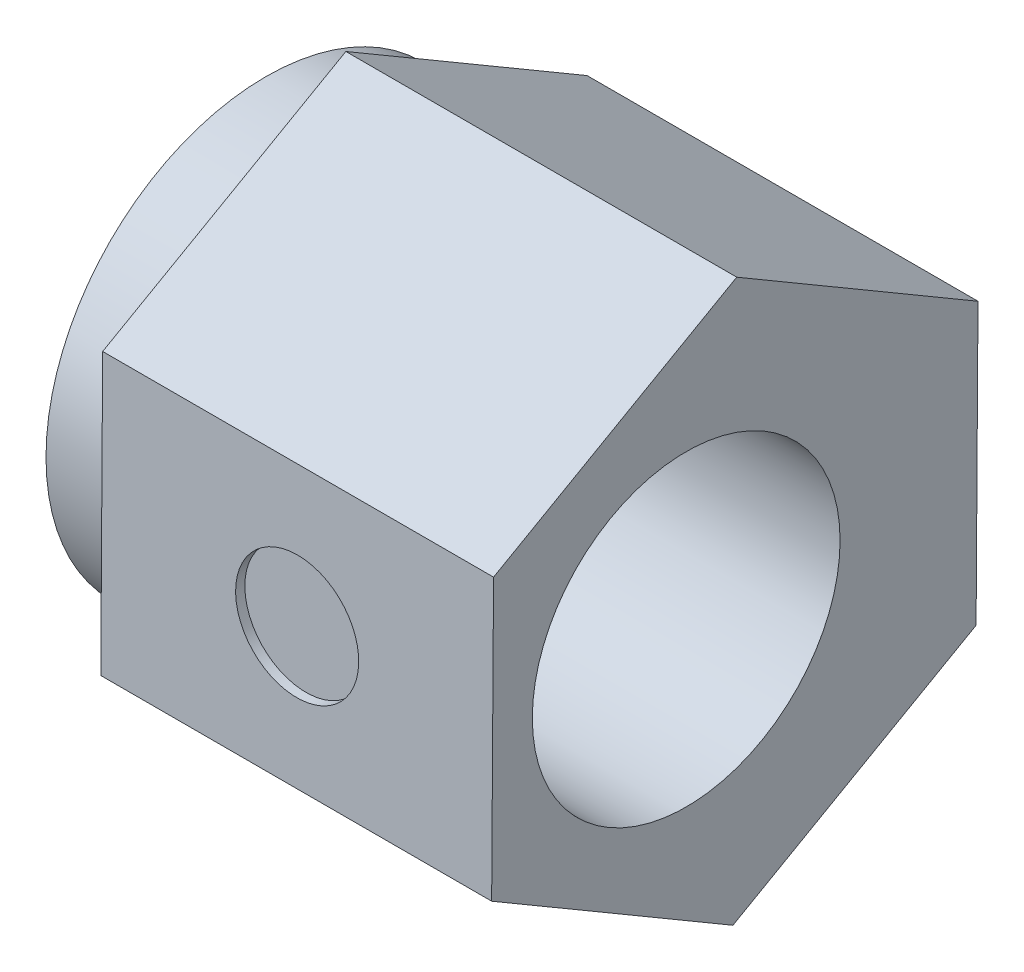
ISO-10303-21;
HEADER;
FILE_DESCRIPTION(('STEP AP214'),'2;1');
FILE_NAME('part.step','',(''),(''),'','','');
FILE_SCHEMA(('AUTOMOTIVE_DESIGN { 1 0 10303 214 1 1 1 1 }'));
ENDSEC;
DATA;
#1=APPLICATION_CONTEXT('core data for automotive mechanical design processes');
#2=APPLICATION_PROTOCOL_DEFINITION('international standard','automotive_design',2000,#1);
#3=PRODUCT_CONTEXT('',#1,'mechanical');
#4=PRODUCT('Part','Part','',(#3));
#5=PRODUCT_RELATED_PRODUCT_CATEGORY('part','',(#4));
#6=PRODUCT_DEFINITION_FORMATION('','',#4);
#7=PRODUCT_DEFINITION_CONTEXT('part definition',#1,'design');
#8=PRODUCT_DEFINITION('design','',#6,#7);
#9=PRODUCT_DEFINITION_SHAPE('','',#8);
#10=(LENGTH_UNIT() NAMED_UNIT(*) SI_UNIT(.MILLI.,.METRE.));
#11=(NAMED_UNIT(*) PLANE_ANGLE_UNIT() SI_UNIT($,.RADIAN.));
#12=(NAMED_UNIT(*) SI_UNIT($,.STERADIAN.) SOLID_ANGLE_UNIT());
#13=UNCERTAINTY_MEASURE_WITH_UNIT(LENGTH_MEASURE(1.E-05),#10,'distance_accuracy_value','');
#14=(GEOMETRIC_REPRESENTATION_CONTEXT(3) GLOBAL_UNCERTAINTY_ASSIGNED_CONTEXT((#13)) GLOBAL_UNIT_ASSIGNED_CONTEXT((#10,
#11,#12)) REPRESENTATION_CONTEXT('',''));
#15=CARTESIAN_POINT('',(0.,0.,0.));
#16=DIRECTION('',(0.,0.,1.));
#17=DIRECTION('',(1.,0.,0.));
#18=AXIS2_PLACEMENT_3D('',#15,#16,#17);
#19=CARTESIAN_POINT('',(6.35,2.29861751972744,3.91943756568916));
#20=DIRECTION('',(0.,-0.00680988299330344,-0.999976812477978));
#21=DIRECTION('',(0.,0.999976812477978,-0.00680988299330344));
#22=AXIS2_PLACEMENT_3D('',#19,#20,#21);
#23=PLANE('',#22);
#24=DIRECTION('',(0.,-0.999976812477978,0.00680988299330344));
#25=VECTOR('',#24,1.);
#26=CARTESIAN_POINT('',(0.,2.29861751972744,3.91943756568916));
#27=LINE('',#26,#25);
#28=CARTESIAN_POINT('',(0.,2.29861751972744,3.91943756568916));
#29=VERTEX_POINT('',#28);
#30=CARTESIAN_POINT('',(0.,-2.24502374057014,3.95037994851252));
#31=VERTEX_POINT('',#30);
#32=EDGE_CURVE('E77',#29,#31,#27,.T.);
#33=ORIENTED_EDGE('',*,*,#32,.T.);
#34=DIRECTION('',(-1.,0.,0.));
#35=VECTOR('',#34,1.);
#36=CARTESIAN_POINT('',(6.35,-2.24502374057014,3.95037994851252));
#37=LINE('',#36,#35);
#38=CARTESIAN_POINT('',(6.35,-2.24502374057014,3.95037994851252));
#39=VERTEX_POINT('',#38);
#40=EDGE_CURVE('E117',#39,#31,#37,.T.);
#41=ORIENTED_EDGE('',*,*,#40,.F.);
#42=DIRECTION('',(0.,-0.999976812477978,0.00680988299330344));
#43=VECTOR('',#42,1.);
#44=CARTESIAN_POINT('',(6.35,2.29861751972744,3.91943756568916));
#45=LINE('',#44,#43);
#46=CARTESIAN_POINT('',(6.35,2.29861751972744,3.91943756568916));
#47=VERTEX_POINT('',#46);
#48=EDGE_CURVE('E103',#47,#39,#45,.T.);
#49=ORIENTED_EDGE('',*,*,#48,.F.);
#50=DIRECTION('',(-1.,0.,0.));
#51=VECTOR('',#50,1.);
#52=CARTESIAN_POINT('',(6.35,2.29861751972744,3.91943756568916));
#53=LINE('',#52,#51);
#54=EDGE_CURVE('E111',#47,#29,#53,.T.);
#55=ORIENTED_EDGE('',*,*,#54,.T.);
#56=EDGE_LOOP('',(#33,#41,#49,#55));
#57=FACE_BOUND('',#56,.T.);
#58=CARTESIAN_POINT('',(3.175,0.026796889578649,3.93490875710084));
#59=DIRECTION('',(0.,-0.00680988299330344,-0.999976812477978));
#60=DIRECTION('',(0.,0.999976812477978,-0.00680988299330344));
#61=AXIS2_PLACEMENT_3D('',#58,#59,#60);
#62=CIRCLE('',#61,0.999999999999998);
#63=CARTESIAN_POINT('',(3.175,1.02677370205663,3.92809887410754));
#64=VERTEX_POINT('',#63);
#65=EDGE_CURVE('E184',#64,#64,#62,.T.);
#66=ORIENTED_EDGE('',*,*,#65,.T.);
#67=EDGE_LOOP('',(#66));
#68=FACE_BOUND('',#67,.T.);
#69=ADVANCED_FACE('F36',(#57,#68),#23,.F.);
#70=CARTESIAN_POINT('',(0.,0.,0.));
#71=DIRECTION('',(1.,0.,0.));
#72=DIRECTION('',(0.,0.,-1.));
#73=AXIS2_PLACEMENT_3D('',#70,#71,#72);
#74=PLANE('',#73);
#75=DIRECTION('',(0.,0.494090874569989,-0.869410264297968));
#76=VECTOR('',#75,1.);
#77=CARTESIAN_POINT('',(0.,-4.54364126029758,0.0309423828233433));
#78=LINE('',#77,#76);
#79=CARTESIAN_POINT('',(0.,-4.54364126029758,0.0309423828233433));
#80=VERTEX_POINT('',#79);
#81=CARTESIAN_POINT('',(0.,-2.29861751972745,-3.91943756568916));
#82=VERTEX_POINT('',#81);
#83=EDGE_CURVE('E129',#80,#82,#78,.T.);
#84=ORIENTED_EDGE('',*,*,#83,.F.);
#85=DIRECTION('',(0.,-0.50588593790799,-0.862600381304665));
#86=VECTOR('',#85,1.);
#87=CARTESIAN_POINT('',(0.,-2.24502374057014,3.95037994851252));
#88=LINE('',#87,#86);
#89=EDGE_CURVE('E83',#31,#80,#88,.T.);
#90=ORIENTED_EDGE('',*,*,#89,.F.);
#91=ORIENTED_EDGE('',*,*,#32,.F.);
#92=DIRECTION('',(0.,-0.494090874569989,0.869410264297968));
#93=VECTOR('',#92,1.);
#94=CARTESIAN_POINT('',(0.,4.54364126029758,-0.0309423828233572));
#95=LINE('',#94,#93);
#96=CARTESIAN_POINT('',(0.,4.54364126029758,-0.0309423828233572));
#97=VERTEX_POINT('',#96);
#98=EDGE_CURVE('E114',#97,#29,#95,.T.);
#99=ORIENTED_EDGE('',*,*,#98,.F.);
#100=DIRECTION('',(0.,0.505885937907989,0.862600381304665));
#101=VECTOR('',#100,1.);
#102=CARTESIAN_POINT('',(0.,2.24502374057014,-3.95037994851252));
#103=LINE('',#102,#101);
#104=CARTESIAN_POINT('',(0.,2.24502374057014,-3.95037994851252));
#105=VERTEX_POINT('',#104);
#106=EDGE_CURVE('E137',#105,#97,#103,.T.);
#107=ORIENTED_EDGE('',*,*,#106,.F.);
#108=DIRECTION('',(0.,0.999976812477978,-0.00680988299330266));
#109=VECTOR('',#108,1.);
#110=CARTESIAN_POINT('',(0.,-2.29861751972745,-3.91943756568916));
#111=LINE('',#110,#109);
#112=EDGE_CURVE('E133',#82,#105,#111,.T.);
#113=ORIENTED_EDGE('',*,*,#112,.F.);
#114=EDGE_LOOP('',(#84,#90,#91,#99,#107,#113));
#115=FACE_BOUND('',#114,.T.);
#116=CARTESIAN_POINT('',(0.,0.,0.));
#117=DIRECTION('',(1.,0.,0.));
#118=DIRECTION('',(0.,0.,-1.));
#119=AXIS2_PLACEMENT_3D('',#116,#117,#118);
#120=CIRCLE('',#119,3.57);
#121=CARTESIAN_POINT('',(0.,0.,-3.57));
#122=VERTEX_POINT('',#121);
#123=EDGE_CURVE('E11',#122,#122,#120,.F.);
#124=ORIENTED_EDGE('',*,*,#123,.F.);
#125=EDGE_LOOP('',(#124));
#126=FACE_BOUND('',#125,.T.);
#127=ADVANCED_FACE('F162',(#115,#126),#74,.F.);
#128=CARTESIAN_POINT('',(6.35,-4.54364126029758,0.0309423828233433));
#129=DIRECTION('',(0.,0.869410264297968,0.494090874569989));
#130=DIRECTION('',(0.,-0.494090874569989,0.869410264297969));
#131=AXIS2_PLACEMENT_3D('',#128,#129,#130);
#132=PLANE('',#131);
#133=ORIENTED_EDGE('',*,*,#83,.T.);
#134=DIRECTION('',(-1.,0.,0.));
#135=VECTOR('',#134,1.);
#136=CARTESIAN_POINT('',(6.35,-2.29861751972745,-3.91943756568916));
#137=LINE('',#136,#135);
#138=CARTESIAN_POINT('',(6.35,-2.29861751972745,-3.91943756568916));
#139=VERTEX_POINT('',#138);
#140=EDGE_CURVE('E46',#139,#82,#137,.T.);
#141=ORIENTED_EDGE('',*,*,#140,.F.);
#142=DIRECTION('',(0.,0.494090874569989,-0.869410264297968));
#143=VECTOR('',#142,1.);
#144=CARTESIAN_POINT('',(6.35,-4.54364126029758,0.0309423828233433));
#145=LINE('',#144,#143);
#146=CARTESIAN_POINT('',(6.35,-4.54364126029758,0.0309423828233433));
#147=VERTEX_POINT('',#146);
#148=EDGE_CURVE('E145',#147,#139,#145,.T.);
#149=ORIENTED_EDGE('',*,*,#148,.F.);
#150=DIRECTION('',(-1.,0.,0.));
#151=VECTOR('',#150,1.);
#152=CARTESIAN_POINT('',(6.35,-4.54364126029758,0.0309423828233433));
#153=LINE('',#152,#151);
#154=EDGE_CURVE('E125',#147,#80,#153,.T.);
#155=ORIENTED_EDGE('',*,*,#154,.T.);
#156=EDGE_LOOP('',(#133,#141,#149,#155));
#157=FACE_BOUND('',#156,.T.);
#158=ADVANCED_FACE('F38',(#157),#132,.F.);
#159=CARTESIAN_POINT('',(6.35,-2.29861751972745,-3.91943756568916));
#160=DIRECTION('',(0.,0.00680988299330266,0.999976812477978));
#161=DIRECTION('',(0.,-0.999976812477978,0.00680988299330266));
#162=AXIS2_PLACEMENT_3D('',#159,#160,#161);
#163=PLANE('',#162);
#164=ORIENTED_EDGE('',*,*,#112,.T.);
#165=DIRECTION('',(-1.,0.,0.));
#166=VECTOR('',#165,1.);
#167=CARTESIAN_POINT('',(6.35,2.24502374057014,-3.95037994851252));
#168=LINE('',#167,#166);
#169=CARTESIAN_POINT('',(6.35,2.24502374057014,-3.95037994851252));
#170=VERTEX_POINT('',#169);
#171=EDGE_CURVE('E151',#170,#105,#168,.T.);
#172=ORIENTED_EDGE('',*,*,#171,.F.);
#173=DIRECTION('',(0.,0.999976812477978,-0.00680988299330266));
#174=VECTOR('',#173,1.);
#175=CARTESIAN_POINT('',(6.35,-2.29861751972745,-3.91943756568916));
#176=LINE('',#175,#174);
#177=EDGE_CURVE('E92',#139,#170,#176,.T.);
#178=ORIENTED_EDGE('',*,*,#177,.F.);
#179=ORIENTED_EDGE('',*,*,#140,.T.);
#180=EDGE_LOOP('',(#164,#172,#178,#179));
#181=FACE_BOUND('',#180,.T.);
#182=ADVANCED_FACE('F157',(#181),#163,.F.);
#183=CARTESIAN_POINT('',(6.35,2.24502374057014,-3.95037994851252));
#184=DIRECTION('',(0.,-0.862600381304665,0.505885937907989));
#185=DIRECTION('',(0.,-0.505885937907989,-0.862600381304665));
#186=AXIS2_PLACEMENT_3D('',#183,#184,#185);
#187=PLANE('',#186);
#188=ORIENTED_EDGE('',*,*,#106,.T.);
#189=DIRECTION('',(-1.,0.,0.));
#190=VECTOR('',#189,1.);
#191=CARTESIAN_POINT('',(6.35,4.54364126029758,-0.0309423828233572));
#192=LINE('',#191,#190);
#193=CARTESIAN_POINT('',(6.35,4.54364126029758,-0.0309423828233572));
#194=VERTEX_POINT('',#193);
#195=EDGE_CURVE('E116',#194,#97,#192,.T.);
#196=ORIENTED_EDGE('',*,*,#195,.F.);
#197=DIRECTION('',(0.,0.505885937907989,0.862600381304665));
#198=VECTOR('',#197,1.);
#199=CARTESIAN_POINT('',(6.35,2.24502374057014,-3.95037994851252));
#200=LINE('',#199,#198);
#201=EDGE_CURVE('E105',#170,#194,#200,.T.);
#202=ORIENTED_EDGE('',*,*,#201,.F.);
#203=ORIENTED_EDGE('',*,*,#171,.T.);
#204=EDGE_LOOP('',(#188,#196,#202,#203));
#205=FACE_BOUND('',#204,.T.);
#206=ADVANCED_FACE('F166',(#205),#187,.F.);
#207=CARTESIAN_POINT('',(6.35,4.54364126029758,-0.0309423828233572));
#208=DIRECTION('',(0.,-0.869410264297968,-0.494090874569989));
#209=DIRECTION('',(0.,0.494090874569989,-0.869410264297969));
#210=AXIS2_PLACEMENT_3D('',#207,#208,#209);
#211=PLANE('',#210);
#212=ORIENTED_EDGE('',*,*,#98,.T.);
#213=ORIENTED_EDGE('',*,*,#54,.F.);
#214=DIRECTION('',(0.,-0.494090874569989,0.869410264297968));
#215=VECTOR('',#214,1.);
#216=CARTESIAN_POINT('',(6.35,4.54364126029758,-0.0309423828233572));
#217=LINE('',#216,#215);
#218=EDGE_CURVE('E99',#194,#47,#217,.T.);
#219=ORIENTED_EDGE('',*,*,#218,.F.);
#220=ORIENTED_EDGE('',*,*,#195,.T.);
#221=EDGE_LOOP('',(#212,#213,#219,#220));
#222=FACE_BOUND('',#221,.T.);
#223=ADVANCED_FACE('F112',(#222),#211,.F.);
#224=CARTESIAN_POINT('',(6.35,-2.24502374057014,3.95037994851252));
#225=DIRECTION('',(0.,0.862600381304665,-0.50588593790799));
#226=DIRECTION('',(0.,0.50588593790799,0.862600381304665));
#227=AXIS2_PLACEMENT_3D('',#224,#225,#226);
#228=PLANE('',#227);
#229=ORIENTED_EDGE('',*,*,#89,.T.);
#230=ORIENTED_EDGE('',*,*,#154,.F.);
#231=DIRECTION('',(0.,-0.50588593790799,-0.862600381304665));
#232=VECTOR('',#231,1.);
#233=CARTESIAN_POINT('',(6.35,-2.24502374057014,3.95037994851252));
#234=LINE('',#233,#232);
#235=EDGE_CURVE('E54',#39,#147,#234,.T.);
#236=ORIENTED_EDGE('',*,*,#235,.F.);
#237=ORIENTED_EDGE('',*,*,#40,.T.);
#238=EDGE_LOOP('',(#229,#230,#236,#237));
#239=FACE_BOUND('',#238,.T.);
#240=ADVANCED_FACE('F211',(#239),#228,.F.);
#241=CARTESIAN_POINT('',(6.35,0.,0.));
#242=DIRECTION('',(1.,0.,0.));
#243=DIRECTION('',(0.,0.,-1.));
#244=AXIS2_PLACEMENT_3D('',#241,#242,#243);
#245=PLANE('',#244);
#246=CARTESIAN_POINT('',(6.35,0.,0.79));
#247=DIRECTION('',(-1.,0.,0.));
#248=DIRECTION('',(0.,0.,1.));
#249=AXIS2_PLACEMENT_3D('',#246,#247,#248);
#250=CIRCLE('',#249,2.5);
#251=CARTESIAN_POINT('',(6.35,0.,3.29));
#252=VERTEX_POINT('',#251);
#253=EDGE_CURVE('E175',#252,#252,#250,.T.);
#254=ORIENTED_EDGE('',*,*,#253,.T.);
#255=EDGE_LOOP('',(#254));
#256=FACE_BOUND('',#255,.T.);
#257=ORIENTED_EDGE('',*,*,#148,.T.);
#258=ORIENTED_EDGE('',*,*,#177,.T.);
#259=ORIENTED_EDGE('',*,*,#201,.T.);
#260=ORIENTED_EDGE('',*,*,#218,.T.);
#261=ORIENTED_EDGE('',*,*,#48,.T.);
#262=ORIENTED_EDGE('',*,*,#235,.T.);
#263=EDGE_LOOP('',(#257,#258,#259,#260,#261,#262));
#264=FACE_BOUND('',#263,.T.);
#265=ADVANCED_FACE('F101',(#256,#264),#245,.T.);
#266=CARTESIAN_POINT('',(-1.27,0.,0.));
#267=DIRECTION('',(1.,0.,0.));
#268=DIRECTION('',(0.,0.,-1.));
#269=AXIS2_PLACEMENT_3D('',#266,#267,#268);
#270=CYLINDRICAL_SURFACE('',#269,3.57);
#271=CARTESIAN_POINT('',(-1.27,0.,0.));
#272=DIRECTION('',(-1.,0.,0.));
#273=DIRECTION('',(0.,0.,1.));
#274=AXIS2_PLACEMENT_3D('',#271,#272,#273);
#275=CIRCLE('',#274,3.57);
#276=CARTESIAN_POINT('',(-1.27,0.,3.57));
#277=VERTEX_POINT('',#276);
#278=EDGE_CURVE('E134',#277,#277,#275,.T.);
#279=ORIENTED_EDGE('',*,*,#278,.F.);
#280=EDGE_LOOP('',(#279));
#281=FACE_BOUND('',#280,.T.);
#282=ORIENTED_EDGE('',*,*,#123,.T.);
#283=EDGE_LOOP('',(#282));
#284=FACE_BOUND('',#283,.T.);
#285=ADVANCED_FACE('F259',(#281,#284),#270,.T.);
#286=CARTESIAN_POINT('',(-1.27,0.,0.));
#287=DIRECTION('',(-1.,0.,0.));
#288=DIRECTION('',(0.,0.,1.));
#289=AXIS2_PLACEMENT_3D('',#286,#287,#288);
#290=PLANE('',#289);
#291=CARTESIAN_POINT('',(-1.27,0.,0.79));
#292=DIRECTION('',(-1.,0.,0.));
#293=DIRECTION('',(0.,0.,1.));
#294=AXIS2_PLACEMENT_3D('',#291,#292,#293);
#295=CIRCLE('',#294,2.5);
#296=CARTESIAN_POINT('',(-1.27,0.,3.29));
#297=VERTEX_POINT('',#296);
#298=EDGE_CURVE('E176',#297,#297,#295,.T.);
#299=ORIENTED_EDGE('',*,*,#298,.F.);
#300=EDGE_LOOP('',(#299));
#301=FACE_BOUND('',#300,.T.);
#302=ORIENTED_EDGE('',*,*,#278,.T.);
#303=EDGE_LOOP('',(#302));
#304=FACE_BOUND('',#303,.T.);
#305=ADVANCED_FACE('F253',(#301,#304),#290,.T.);
#306=CARTESIAN_POINT('',(6.35,0.,0.79));
#307=DIRECTION('',(-1.,0.,0.));
#308=DIRECTION('',(0.,0.,1.));
#309=AXIS2_PLACEMENT_3D('',#306,#307,#308);
#310=CYLINDRICAL_SURFACE('',#309,2.5);
#311=ORIENTED_EDGE('',*,*,#253,.F.);
#312=EDGE_LOOP('',(#311));
#313=FACE_BOUND('',#312,.T.);
#314=ORIENTED_EDGE('',*,*,#298,.T.);
#315=EDGE_LOOP('',(#314));
#316=FACE_BOUND('',#315,.T.);
#317=ADVANCED_FACE('F201',(#313,#316),#310,.F.);
#318=CARTESIAN_POINT('',(3.175,0.0257754071296535,3.78491223522914));
#319=DIRECTION('',(0.,0.00680988299330344,0.999976812477978));
#320=DIRECTION('',(0.,-0.999976812477978,0.00680988299330344));
#321=AXIS2_PLACEMENT_3D('',#318,#319,#320);
#322=CYLINDRICAL_SURFACE('',#321,0.999999999999998);
#323=CARTESIAN_POINT('',(3.175,0.0257754071296535,3.78491223522914));
#324=DIRECTION('',(0.,-0.00680988299330344,-0.999976812477978));
#325=DIRECTION('',(0.,0.999976812477978,-0.00680988299330344));
#326=AXIS2_PLACEMENT_3D('',#323,#324,#325);
#327=CIRCLE('',#326,0.999999999999998);
#328=CARTESIAN_POINT('',(3.175,1.02575221960763,3.77810235223584));
#329=VERTEX_POINT('',#328);
#330=EDGE_CURVE('E180',#329,#329,#327,.T.);
#331=ORIENTED_EDGE('',*,*,#330,.T.);
#332=EDGE_LOOP('',(#331));
#333=FACE_BOUND('',#332,.T.);
#334=ORIENTED_EDGE('',*,*,#65,.F.);
#335=EDGE_LOOP('',(#334));
#336=FACE_BOUND('',#335,.T.);
#337=ADVANCED_FACE('F192',(#333,#336),#322,.F.);
#338=CARTESIAN_POINT('',(3.175,0.0257754071296535,3.78491223522914));
#339=DIRECTION('',(0.,-0.00680988299330344,-0.999976812477978));
#340=DIRECTION('',(0.,0.999976812477978,-0.00680988299330344));
#341=AXIS2_PLACEMENT_3D('',#338,#339,#340);
#342=PLANE('',#341);
#343=ORIENTED_EDGE('',*,*,#330,.F.);
#344=EDGE_LOOP('',(#343));
#345=FACE_BOUND('',#344,.T.);
#346=ADVANCED_FACE('F195',(#345),#342,.F.);
#347=CLOSED_SHELL('',(#69,#127,#158,#182,#206,#223,#240,#265,#285,#305,#317,#337,#346));
#348=MANIFOLD_SOLID_BREP('B2',#347);
#349=ADVANCED_BREP_SHAPE_REPRESENTATION('',(#18,#348),#14);
#350=SHAPE_DEFINITION_REPRESENTATION(#9,#349);
ENDSEC;
END-ISO-10303-21;
